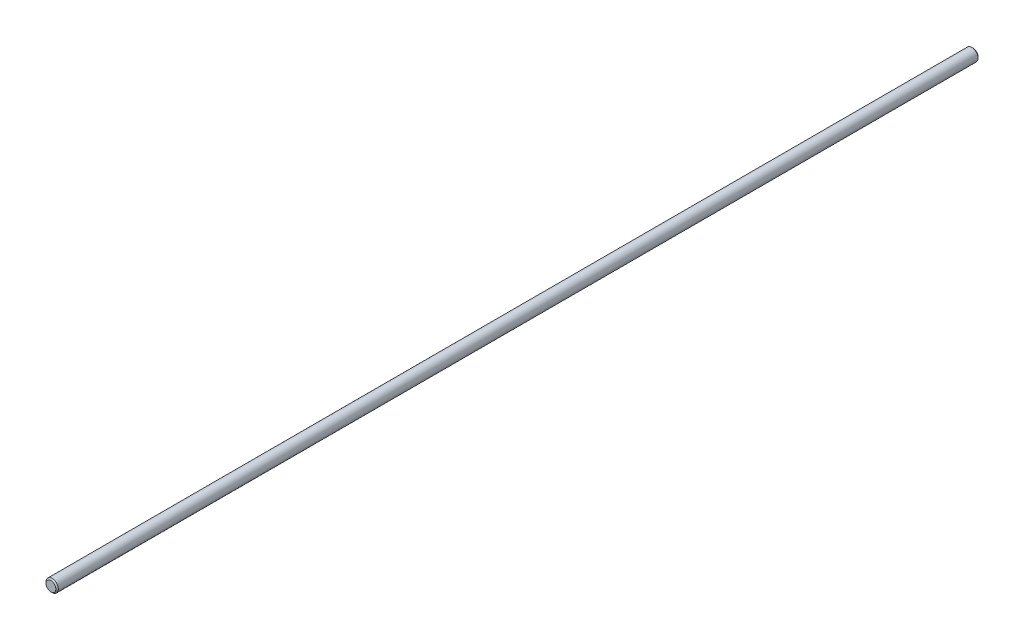
ISO-10303-21;
HEADER;
FILE_DESCRIPTION(('STEP AP214'),'2;1');
FILE_NAME('part.step','',(''),(''),'','','');
FILE_SCHEMA(('AUTOMOTIVE_DESIGN { 1 0 10303 214 1 1 1 1 }'));
ENDSEC;
DATA;
#1=APPLICATION_CONTEXT('core data for automotive mechanical design processes');
#2=APPLICATION_PROTOCOL_DEFINITION('international standard','automotive_design',2000,#1);
#3=PRODUCT_CONTEXT('',#1,'mechanical');
#4=PRODUCT('Part','Part','',(#3));
#5=PRODUCT_RELATED_PRODUCT_CATEGORY('part','',(#4));
#6=PRODUCT_DEFINITION_FORMATION('','',#4);
#7=PRODUCT_DEFINITION_CONTEXT('part definition',#1,'design');
#8=PRODUCT_DEFINITION('design','',#6,#7);
#9=PRODUCT_DEFINITION_SHAPE('','',#8);
#10=(LENGTH_UNIT() NAMED_UNIT(*) SI_UNIT(.MILLI.,.METRE.));
#11=(NAMED_UNIT(*) PLANE_ANGLE_UNIT() SI_UNIT($,.RADIAN.));
#12=(NAMED_UNIT(*) SI_UNIT($,.STERADIAN.) SOLID_ANGLE_UNIT());
#13=UNCERTAINTY_MEASURE_WITH_UNIT(LENGTH_MEASURE(1.E-05),#10,'distance_accuracy_value','');
#14=(GEOMETRIC_REPRESENTATION_CONTEXT(3) GLOBAL_UNCERTAINTY_ASSIGNED_CONTEXT((#13)) GLOBAL_UNIT_ASSIGNED_CONTEXT((#10,
#11,#12)) REPRESENTATION_CONTEXT('',''));
#15=CARTESIAN_POINT('',(0.,0.,0.));
#16=DIRECTION('',(0.,0.,1.));
#17=DIRECTION('',(1.,0.,0.));
#18=AXIS2_PLACEMENT_3D('',#15,#16,#17);
#19=CARTESIAN_POINT('',(0.,0.,600.));
#20=DIRECTION('',(0.,0.,-1.));
#21=DIRECTION('',(-1.,0.,0.));
#22=AXIS2_PLACEMENT_3D('',#19,#20,#21);
#23=CYLINDRICAL_SURFACE('',#22,8.);
#24=CARTESIAN_POINT('',(0.,0.,-598.4));
#25=DIRECTION('',(0.,0.,1.));
#26=DIRECTION('',(1.,0.,0.));
#27=AXIS2_PLACEMENT_3D('',#24,#25,#26);
#28=CIRCLE('',#27,8.);
#29=CARTESIAN_POINT('',(8.,0.,-598.4));
#30=VERTEX_POINT('',#29);
#31=EDGE_CURVE('E41',#30,#30,#28,.T.);
#32=ORIENTED_EDGE('',*,*,#31,.T.);
#33=EDGE_LOOP('',(#32));
#34=FACE_BOUND('',#33,.T.);
#35=CARTESIAN_POINT('',(0.,0.,598.4));
#36=DIRECTION('',(0.,0.,1.));
#37=DIRECTION('',(1.,0.,0.));
#38=AXIS2_PLACEMENT_3D('',#35,#36,#37);
#39=CIRCLE('',#38,8.);
#40=CARTESIAN_POINT('',(8.,0.,598.4));
#41=VERTEX_POINT('',#40);
#42=EDGE_CURVE('E45',#41,#41,#39,.F.);
#43=ORIENTED_EDGE('',*,*,#42,.T.);
#44=EDGE_LOOP('',(#43));
#45=FACE_BOUND('',#44,.T.);
#46=ADVANCED_FACE('F30',(#34,#45),#23,.T.);
#47=CARTESIAN_POINT('',(0.,0.,600.));
#48=DIRECTION('',(0.,0.,1.));
#49=DIRECTION('',(1.,0.,0.));
#50=AXIS2_PLACEMENT_3D('',#47,#48,#49);
#51=PLANE('',#50);
#52=CARTESIAN_POINT('',(0.,0.,600.));
#53=DIRECTION('',(0.,0.,1.));
#54=DIRECTION('',(1.,0.,0.));
#55=AXIS2_PLACEMENT_3D('',#52,#53,#54);
#56=CIRCLE('',#55,6.39999999999985);
#57=CARTESIAN_POINT('',(6.39999999999985,0.,600.));
#58=VERTEX_POINT('',#57);
#59=EDGE_CURVE('E10',#58,#58,#56,.T.);
#60=ORIENTED_EDGE('',*,*,#59,.T.);
#61=EDGE_LOOP('',(#60));
#62=FACE_BOUND('',#61,.T.);
#63=ADVANCED_FACE('F61',(#62),#51,.T.);
#64=CARTESIAN_POINT('',(0.,0.,-600.));
#65=DIRECTION('',(0.,0.,1.));
#66=DIRECTION('',(1.,0.,0.));
#67=AXIS2_PLACEMENT_3D('',#64,#65,#66);
#68=PLANE('',#67);
#69=CARTESIAN_POINT('',(0.,0.,-600.));
#70=DIRECTION('',(0.,0.,1.));
#71=DIRECTION('',(1.,0.,0.));
#72=AXIS2_PLACEMENT_3D('',#69,#70,#71);
#73=CIRCLE('',#72,6.39999999999974);
#74=CARTESIAN_POINT('',(6.39999999999974,0.,-600.));
#75=VERTEX_POINT('',#74);
#76=EDGE_CURVE('E37',#75,#75,#73,.F.);
#77=ORIENTED_EDGE('',*,*,#76,.T.);
#78=EDGE_LOOP('',(#77));
#79=FACE_BOUND('',#78,.T.);
#80=ADVANCED_FACE('F58',(#79),#68,.F.);
#81=CARTESIAN_POINT('',(0.,0.,-598.4));
#82=DIRECTION('',(0.,0.,1.));
#83=DIRECTION('',(1.,0.,0.));
#84=AXIS2_PLACEMENT_3D('',#81,#82,#83);
#85=CONICAL_SURFACE('',#84,8.,0.785398163397377);
#86=ORIENTED_EDGE('',*,*,#76,.F.);
#87=EDGE_LOOP('',(#86));
#88=FACE_BOUND('',#87,.T.);
#89=ORIENTED_EDGE('',*,*,#31,.F.);
#90=EDGE_LOOP('',(#89));
#91=FACE_BOUND('',#90,.T.);
#92=ADVANCED_FACE('F54',(#88,#91),#85,.T.);
#93=CARTESIAN_POINT('',(0.,0.,600.));
#94=DIRECTION('',(0.,0.,-1.));
#95=DIRECTION('',(-1.,0.,0.));
#96=AXIS2_PLACEMENT_3D('',#93,#94,#95);
#97=CONICAL_SURFACE('',#96,6.39999999999985,0.785398163397446);
#98=ORIENTED_EDGE('',*,*,#42,.F.);
#99=EDGE_LOOP('',(#98));
#100=FACE_BOUND('',#99,.T.);
#101=ORIENTED_EDGE('',*,*,#59,.F.);
#102=EDGE_LOOP('',(#101));
#103=FACE_BOUND('',#102,.T.);
#104=ADVANCED_FACE('F32',(#100,#103),#97,.T.);
#105=CLOSED_SHELL('',(#46,#63,#80,#92,#104));
#106=MANIFOLD_SOLID_BREP('B2',#105);
#107=ADVANCED_BREP_SHAPE_REPRESENTATION('',(#18,#106),#14);
#108=SHAPE_DEFINITION_REPRESENTATION(#9,#107);
ENDSEC;
END-ISO-10303-21;
